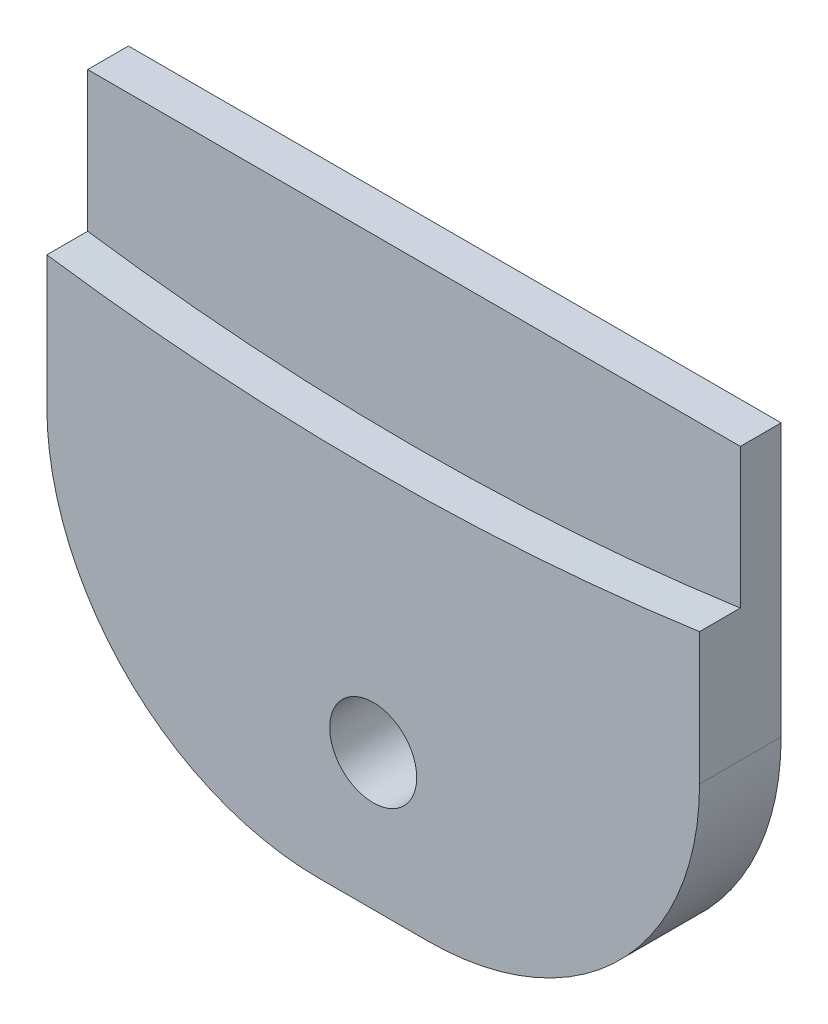
ISO-10303-21;
HEADER;
FILE_DESCRIPTION(('STEP AP214'),'2;1');
FILE_NAME('part.step','',(''),(''),'','','');
FILE_SCHEMA(('AUTOMOTIVE_DESIGN { 1 0 10303 214 1 1 1 1 }'));
ENDSEC;
DATA;
#1=APPLICATION_CONTEXT('core data for automotive mechanical design processes');
#2=APPLICATION_PROTOCOL_DEFINITION('international standard','automotive_design',2000,#1);
#3=PRODUCT_CONTEXT('',#1,'mechanical');
#4=PRODUCT('Part','Part','',(#3));
#5=PRODUCT_RELATED_PRODUCT_CATEGORY('part','',(#4));
#6=PRODUCT_DEFINITION_FORMATION('','',#4);
#7=PRODUCT_DEFINITION_CONTEXT('part definition',#1,'design');
#8=PRODUCT_DEFINITION('design','',#6,#7);
#9=PRODUCT_DEFINITION_SHAPE('','',#8);
#10=(LENGTH_UNIT() NAMED_UNIT(*) SI_UNIT(.MILLI.,.METRE.));
#11=(NAMED_UNIT(*) PLANE_ANGLE_UNIT() SI_UNIT($,.RADIAN.));
#12=(NAMED_UNIT(*) SI_UNIT($,.STERADIAN.) SOLID_ANGLE_UNIT());
#13=UNCERTAINTY_MEASURE_WITH_UNIT(LENGTH_MEASURE(1.E-05),#10,'distance_accuracy_value','');
#14=(GEOMETRIC_REPRESENTATION_CONTEXT(3) GLOBAL_UNCERTAINTY_ASSIGNED_CONTEXT((#13)) GLOBAL_UNIT_ASSIGNED_CONTEXT((#10,
#11,#12)) REPRESENTATION_CONTEXT('',''));
#15=CARTESIAN_POINT('',(0.,0.,0.));
#16=DIRECTION('',(0.,0.,1.));
#17=DIRECTION('',(1.,0.,0.));
#18=AXIS2_PLACEMENT_3D('',#15,#16,#17);
#19=CARTESIAN_POINT('',(-12.,20.,3.));
#20=DIRECTION('',(0.,-1.,0.));
#21=DIRECTION('',(0.,0.,-1.));
#22=AXIS2_PLACEMENT_3D('',#19,#20,#21);
#23=PLANE('',#22);
#24=DIRECTION('',(-1.,0.,0.));
#25=VECTOR('',#24,1.);
#26=CARTESIAN_POINT('',(-12.,20.,1.5));
#27=LINE('',#26,#25);
#28=CARTESIAN_POINT('',(12.,20.,1.5));
#29=VERTEX_POINT('',#28);
#30=CARTESIAN_POINT('',(-12.,20.,1.5));
#31=VERTEX_POINT('',#30);
#32=EDGE_CURVE('E123',#29,#31,#27,.T.);
#33=ORIENTED_EDGE('',*,*,#32,.F.);
#34=DIRECTION('',(0.,0.,-1.));
#35=VECTOR('',#34,1.);
#36=CARTESIAN_POINT('',(12.,20.,3.));
#37=LINE('',#36,#35);
#38=CARTESIAN_POINT('',(12.,20.,0.));
#39=VERTEX_POINT('',#38);
#40=EDGE_CURVE('E122',#29,#39,#37,.T.);
#41=ORIENTED_EDGE('',*,*,#40,.T.);
#42=DIRECTION('',(-1.,0.,0.));
#43=VECTOR('',#42,1.);
#44=CARTESIAN_POINT('',(-12.,20.,0.));
#45=LINE('',#44,#43);
#46=CARTESIAN_POINT('',(-12.,20.,0.));
#47=VERTEX_POINT('',#46);
#48=EDGE_CURVE('E140',#39,#47,#45,.T.);
#49=ORIENTED_EDGE('',*,*,#48,.T.);
#50=DIRECTION('',(0.,0.,-1.));
#51=VECTOR('',#50,1.);
#52=CARTESIAN_POINT('',(-12.,20.,3.));
#53=LINE('',#52,#51);
#54=EDGE_CURVE('E144',#31,#47,#53,.T.);
#55=ORIENTED_EDGE('',*,*,#54,.F.);
#56=EDGE_LOOP('',(#33,#41,#49,#55));
#57=FACE_BOUND('',#56,.T.);
#58=ADVANCED_FACE('F32',(#57),#23,.F.);
#59=CARTESIAN_POINT('',(-12.,20.,3.));
#60=DIRECTION('',(1.,0.,0.));
#61=DIRECTION('',(0.,1.,0.));
#62=AXIS2_PLACEMENT_3D('',#59,#60,#61);
#63=PLANE('',#62);
#64=DIRECTION('',(0.,-1.,0.));
#65=VECTOR('',#64,1.);
#66=CARTESIAN_POINT('',(-12.,20.,0.));
#67=LINE('',#66,#65);
#68=CARTESIAN_POINT('',(-12.,10.,0.));
#69=VERTEX_POINT('',#68);
#70=EDGE_CURVE('E134',#47,#69,#67,.T.);
#71=ORIENTED_EDGE('',*,*,#70,.T.);
#72=DIRECTION('',(0.,0.,-1.));
#73=VECTOR('',#72,1.);
#74=CARTESIAN_POINT('',(-12.,10.,3.));
#75=LINE('',#74,#73);
#76=CARTESIAN_POINT('',(-12.,10.,3.));
#77=VERTEX_POINT('',#76);
#78=EDGE_CURVE('E55',#69,#77,#75,.F.);
#79=ORIENTED_EDGE('',*,*,#78,.T.);
#80=DIRECTION('',(0.,-1.,0.));
#81=VECTOR('',#80,1.);
#82=CARTESIAN_POINT('',(-12.,20.,3.));
#83=LINE('',#82,#81);
#84=CARTESIAN_POINT('',(-12.,14.8513220543543,3.));
#85=VERTEX_POINT('',#84);
#86=EDGE_CURVE('E137',#85,#77,#83,.T.);
#87=ORIENTED_EDGE('',*,*,#86,.F.);
#88=DIRECTION('',(0.,0.,1.));
#89=VECTOR('',#88,1.);
#90=CARTESIAN_POINT('',(-12.,14.8513220543543,1.5));
#91=LINE('',#90,#89);
#92=CARTESIAN_POINT('',(-12.,14.8513220543543,1.5));
#93=VERTEX_POINT('',#92);
#94=EDGE_CURVE('E109',#93,#85,#91,.T.);
#95=ORIENTED_EDGE('',*,*,#94,.F.);
#96=DIRECTION('',(0.,-1.,0.));
#97=VECTOR('',#96,1.);
#98=CARTESIAN_POINT('',(-12.,14.8513220543543,1.5));
#99=LINE('',#98,#97);
#100=EDGE_CURVE('E110',#31,#93,#99,.T.);
#101=ORIENTED_EDGE('',*,*,#100,.F.);
#102=ORIENTED_EDGE('',*,*,#54,.T.);
#103=EDGE_LOOP('',(#71,#79,#87,#95,#101,#102));
#104=FACE_BOUND('',#103,.T.);
#105=ADVANCED_FACE('F180',(#104),#63,.F.);
#106=CARTESIAN_POINT('',(-12.,0.,3.));
#107=DIRECTION('',(0.,1.,0.));
#108=DIRECTION('',(0.,0.,1.));
#109=AXIS2_PLACEMENT_3D('',#106,#107,#108);
#110=PLANE('',#109);
#111=DIRECTION('',(1.,0.,0.));
#112=VECTOR('',#111,1.);
#113=CARTESIAN_POINT('',(-12.,0.,3.));
#114=LINE('',#113,#112);
#115=CARTESIAN_POINT('',(-2.,0.,3.));
#116=VERTEX_POINT('',#115);
#117=CARTESIAN_POINT('',(2.,0.,3.));
#118=VERTEX_POINT('',#117);
#119=EDGE_CURVE('E139',#116,#118,#114,.T.);
#120=ORIENTED_EDGE('',*,*,#119,.F.);
#121=DIRECTION('',(0.,0.,-1.));
#122=VECTOR('',#121,1.);
#123=CARTESIAN_POINT('',(-2.,0.,3.));
#124=LINE('',#123,#122);
#125=CARTESIAN_POINT('',(-2.,0.,0.));
#126=VERTEX_POINT('',#125);
#127=EDGE_CURVE('E157',#116,#126,#124,.T.);
#128=ORIENTED_EDGE('',*,*,#127,.T.);
#129=DIRECTION('',(1.,0.,0.));
#130=VECTOR('',#129,1.);
#131=CARTESIAN_POINT('',(-12.,0.,0.));
#132=LINE('',#131,#130);
#133=CARTESIAN_POINT('',(2.,0.,0.));
#134=VERTEX_POINT('',#133);
#135=EDGE_CURVE('E146',#126,#134,#132,.T.);
#136=ORIENTED_EDGE('',*,*,#135,.T.);
#137=DIRECTION('',(0.,0.,-1.));
#138=VECTOR('',#137,1.);
#139=CARTESIAN_POINT('',(2.,0.,3.));
#140=LINE('',#139,#138);
#141=EDGE_CURVE('E155',#134,#118,#140,.F.);
#142=ORIENTED_EDGE('',*,*,#141,.T.);
#143=EDGE_LOOP('',(#120,#128,#136,#142));
#144=FACE_BOUND('',#143,.T.);
#145=ADVANCED_FACE('F172',(#144),#110,.F.);
#146=CARTESIAN_POINT('',(12.,20.,3.));
#147=DIRECTION('',(-1.,0.,0.));
#148=DIRECTION('',(0.,-1.,0.));
#149=AXIS2_PLACEMENT_3D('',#146,#147,#148);
#150=PLANE('',#149);
#151=DIRECTION('',(0.,1.,0.));
#152=VECTOR('',#151,1.);
#153=CARTESIAN_POINT('',(12.,20.,3.));
#154=LINE('',#153,#152);
#155=CARTESIAN_POINT('',(12.,10.,3.));
#156=VERTEX_POINT('',#155);
#157=CARTESIAN_POINT('',(12.,14.8513220543543,3.));
#158=VERTEX_POINT('',#157);
#159=EDGE_CURVE('E142',#156,#158,#154,.T.);
#160=ORIENTED_EDGE('',*,*,#159,.F.);
#161=DIRECTION('',(0.,0.,-1.));
#162=VECTOR('',#161,1.);
#163=CARTESIAN_POINT('',(12.,10.,3.));
#164=LINE('',#163,#162);
#165=CARTESIAN_POINT('',(12.,10.,0.));
#166=VERTEX_POINT('',#165);
#167=EDGE_CURVE('E11',#156,#166,#164,.T.);
#168=ORIENTED_EDGE('',*,*,#167,.T.);
#169=DIRECTION('',(0.,1.,0.));
#170=VECTOR('',#169,1.);
#171=CARTESIAN_POINT('',(12.,20.,0.));
#172=LINE('',#171,#170);
#173=EDGE_CURVE('E149',#166,#39,#172,.T.);
#174=ORIENTED_EDGE('',*,*,#173,.T.);
#175=ORIENTED_EDGE('',*,*,#40,.F.);
#176=DIRECTION('',(0.,1.,0.));
#177=VECTOR('',#176,1.);
#178=CARTESIAN_POINT('',(12.,20.,1.5));
#179=LINE('',#178,#177);
#180=CARTESIAN_POINT('',(12.,14.8513220543543,1.5));
#181=VERTEX_POINT('',#180);
#182=EDGE_CURVE('E114',#181,#29,#179,.T.);
#183=ORIENTED_EDGE('',*,*,#182,.F.);
#184=DIRECTION('',(0.,0.,1.));
#185=VECTOR('',#184,1.);
#186=CARTESIAN_POINT('',(12.,14.8513220543543,1.5));
#187=LINE('',#186,#185);
#188=EDGE_CURVE('E100',#181,#158,#187,.T.);
#189=ORIENTED_EDGE('',*,*,#188,.T.);
#190=EDGE_LOOP('',(#160,#168,#174,#175,#183,#189));
#191=FACE_BOUND('',#190,.T.);
#192=ADVANCED_FACE('F120',(#191),#150,.F.);
#193=CARTESIAN_POINT('',(-12.,0.,3.));
#194=DIRECTION('',(0.,0.,1.));
#195=DIRECTION('',(1.,0.,0.));
#196=AXIS2_PLACEMENT_3D('',#193,#194,#195);
#197=PLANE('',#196);
#198=ORIENTED_EDGE('',*,*,#86,.T.);
#199=CARTESIAN_POINT('',(-2.,10.,3.));
#200=DIRECTION('',(0.,0.,1.));
#201=DIRECTION('',(1.,0.,0.));
#202=AXIS2_PLACEMENT_3D('',#199,#200,#201);
#203=CIRCLE('',#202,10.);
#204=EDGE_CURVE('E40',#77,#116,#203,.T.);
#205=ORIENTED_EDGE('',*,*,#204,.T.);
#206=ORIENTED_EDGE('',*,*,#119,.T.);
#207=CARTESIAN_POINT('',(2.,10.,3.));
#208=DIRECTION('',(0.,0.,1.));
#209=DIRECTION('',(1.,0.,0.));
#210=AXIS2_PLACEMENT_3D('',#207,#208,#209);
#211=CIRCLE('',#210,10.);
#212=EDGE_CURVE('E47',#118,#156,#211,.T.);
#213=ORIENTED_EDGE('',*,*,#212,.T.);
#214=ORIENTED_EDGE('',*,*,#159,.T.);
#215=CARTESIAN_POINT('',(0.,99.,3.));
#216=DIRECTION('',(0.,0.,1.));
#217=DIRECTION('',(1.,0.,0.));
#218=AXIS2_PLACEMENT_3D('',#215,#216,#217);
#219=CIRCLE('',#218,85.);
#220=EDGE_CURVE('E106',#85,#158,#219,.T.);
#221=ORIENTED_EDGE('',*,*,#220,.F.);
#222=EDGE_LOOP('',(#198,#205,#206,#213,#214,#221));
#223=FACE_BOUND('',#222,.T.);
#224=CARTESIAN_POINT('',(0.,5.,3.));
#225=DIRECTION('',(0.,0.,1.));
#226=DIRECTION('',(1.,0.,0.));
#227=AXIS2_PLACEMENT_3D('',#224,#225,#226);
#228=CIRCLE('',#227,1.6);
#229=CARTESIAN_POINT('',(1.6,5.,3.));
#230=VERTEX_POINT('',#229);
#231=EDGE_CURVE('E129',#230,#230,#228,.T.);
#232=ORIENTED_EDGE('',*,*,#231,.F.);
#233=EDGE_LOOP('',(#232));
#234=FACE_BOUND('',#233,.T.);
#235=ADVANCED_FACE('F167',(#223,#234),#197,.T.);
#236=CARTESIAN_POINT('',(-12.,0.,0.));
#237=DIRECTION('',(0.,0.,1.));
#238=DIRECTION('',(1.,0.,0.));
#239=AXIS2_PLACEMENT_3D('',#236,#237,#238);
#240=PLANE('',#239);
#241=CARTESIAN_POINT('',(0.,5.,0.));
#242=DIRECTION('',(0.,0.,1.));
#243=DIRECTION('',(1.,0.,0.));
#244=AXIS2_PLACEMENT_3D('',#241,#242,#243);
#245=CIRCLE('',#244,1.6);
#246=CARTESIAN_POINT('',(1.6,5.,0.));
#247=VERTEX_POINT('',#246);
#248=EDGE_CURVE('E131',#247,#247,#245,.T.);
#249=ORIENTED_EDGE('',*,*,#248,.T.);
#250=EDGE_LOOP('',(#249));
#251=FACE_BOUND('',#250,.T.);
#252=ORIENTED_EDGE('',*,*,#135,.F.);
#253=CARTESIAN_POINT('',(-2.,10.,0.));
#254=DIRECTION('',(0.,0.,1.));
#255=DIRECTION('',(1.,0.,0.));
#256=AXIS2_PLACEMENT_3D('',#253,#254,#255);
#257=CIRCLE('',#256,10.);
#258=EDGE_CURVE('E162',#126,#69,#257,.F.);
#259=ORIENTED_EDGE('',*,*,#258,.T.);
#260=ORIENTED_EDGE('',*,*,#70,.F.);
#261=ORIENTED_EDGE('',*,*,#48,.F.);
#262=ORIENTED_EDGE('',*,*,#173,.F.);
#263=CARTESIAN_POINT('',(2.,10.,0.));
#264=DIRECTION('',(0.,0.,1.));
#265=DIRECTION('',(1.,0.,0.));
#266=AXIS2_PLACEMENT_3D('',#263,#264,#265);
#267=CIRCLE('',#266,10.);
#268=EDGE_CURVE('E160',#166,#134,#267,.F.);
#269=ORIENTED_EDGE('',*,*,#268,.T.);
#270=EDGE_LOOP('',(#252,#259,#260,#261,#262,#269));
#271=FACE_BOUND('',#270,.T.);
#272=ADVANCED_FACE('F178',(#251,#271),#240,.F.);
#273=CARTESIAN_POINT('',(0.,5.,0.));
#274=DIRECTION('',(0.,0.,1.));
#275=DIRECTION('',(1.,0.,0.));
#276=AXIS2_PLACEMENT_3D('',#273,#274,#275);
#277=CYLINDRICAL_SURFACE('',#276,1.6);
#278=ORIENTED_EDGE('',*,*,#248,.F.);
#279=EDGE_LOOP('',(#278));
#280=FACE_BOUND('',#279,.T.);
#281=ORIENTED_EDGE('',*,*,#231,.T.);
#282=EDGE_LOOP('',(#281));
#283=FACE_BOUND('',#282,.T.);
#284=ADVANCED_FACE('F221',(#280,#283),#277,.F.);
#285=CARTESIAN_POINT('',(0.,99.,1.5));
#286=DIRECTION('',(0.,0.,1.));
#287=DIRECTION('',(1.,0.,0.));
#288=AXIS2_PLACEMENT_3D('',#285,#286,#287);
#289=CYLINDRICAL_SURFACE('',#288,85.);
#290=ORIENTED_EDGE('',*,*,#220,.T.);
#291=ORIENTED_EDGE('',*,*,#188,.F.);
#292=CARTESIAN_POINT('',(0.,99.,1.5));
#293=DIRECTION('',(0.,0.,1.));
#294=DIRECTION('',(1.,0.,0.));
#295=AXIS2_PLACEMENT_3D('',#292,#293,#294);
#296=CIRCLE('',#295,85.);
#297=EDGE_CURVE('E103',#93,#181,#296,.T.);
#298=ORIENTED_EDGE('',*,*,#297,.F.);
#299=ORIENTED_EDGE('',*,*,#94,.T.);
#300=EDGE_LOOP('',(#290,#291,#298,#299));
#301=FACE_BOUND('',#300,.T.);
#302=ADVANCED_FACE('F102',(#301),#289,.F.);
#303=CARTESIAN_POINT('',(0.,99.,1.5));
#304=DIRECTION('',(0.,0.,1.));
#305=DIRECTION('',(1.,0.,0.));
#306=AXIS2_PLACEMENT_3D('',#303,#304,#305);
#307=PLANE('',#306);
#308=ORIENTED_EDGE('',*,*,#297,.T.);
#309=ORIENTED_EDGE('',*,*,#182,.T.);
#310=ORIENTED_EDGE('',*,*,#32,.T.);
#311=ORIENTED_EDGE('',*,*,#100,.T.);
#312=EDGE_LOOP('',(#308,#309,#310,#311));
#313=FACE_BOUND('',#312,.T.);
#314=ADVANCED_FACE('F113',(#313),#307,.T.);
#315=CARTESIAN_POINT('',(-2.,10.,3.));
#316=DIRECTION('',(0.,0.,-1.));
#317=DIRECTION('',(-1.,0.,0.));
#318=AXIS2_PLACEMENT_3D('',#315,#316,#317);
#319=CYLINDRICAL_SURFACE('',#318,10.);
#320=ORIENTED_EDGE('',*,*,#204,.F.);
#321=ORIENTED_EDGE('',*,*,#78,.F.);
#322=ORIENTED_EDGE('',*,*,#258,.F.);
#323=ORIENTED_EDGE('',*,*,#127,.F.);
#324=EDGE_LOOP('',(#320,#321,#322,#323));
#325=FACE_BOUND('',#324,.T.);
#326=ADVANCED_FACE('F175',(#325),#319,.T.);
#327=CARTESIAN_POINT('',(2.,10.,3.));
#328=DIRECTION('',(0.,0.,-1.));
#329=DIRECTION('',(-1.,0.,0.));
#330=AXIS2_PLACEMENT_3D('',#327,#328,#329);
#331=CYLINDRICAL_SURFACE('',#330,10.);
#332=ORIENTED_EDGE('',*,*,#212,.F.);
#333=ORIENTED_EDGE('',*,*,#141,.F.);
#334=ORIENTED_EDGE('',*,*,#268,.F.);
#335=ORIENTED_EDGE('',*,*,#167,.F.);
#336=EDGE_LOOP('',(#332,#333,#334,#335));
#337=FACE_BOUND('',#336,.T.);
#338=ADVANCED_FACE('F34',(#337),#331,.T.);
#339=CLOSED_SHELL('',(#58,#105,#145,#192,#235,#272,#284,#302,#314,#326,#338));
#340=MANIFOLD_SOLID_BREP('B2',#339);
#341=ADVANCED_BREP_SHAPE_REPRESENTATION('',(#18,#340),#14);
#342=SHAPE_DEFINITION_REPRESENTATION(#9,#341);
ENDSEC;
END-ISO-10303-21;
